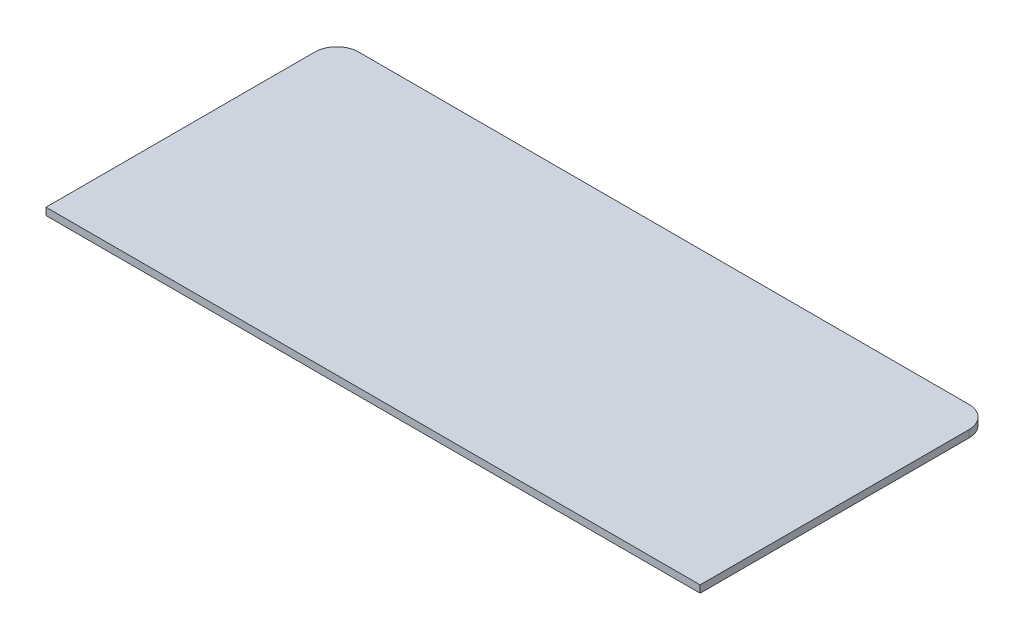
ISO-10303-21;
HEADER;
FILE_DESCRIPTION(('STEP AP214'),'2;1');
FILE_NAME('part.step','',(''),(''),'','','');
FILE_SCHEMA(('AUTOMOTIVE_DESIGN { 1 0 10303 214 1 1 1 1 }'));
ENDSEC;
DATA;
#1=APPLICATION_CONTEXT('core data for automotive mechanical design processes');
#2=APPLICATION_PROTOCOL_DEFINITION('international standard','automotive_design',2000,#1);
#3=PRODUCT_CONTEXT('',#1,'mechanical');
#4=PRODUCT('Part','Part','',(#3));
#5=PRODUCT_RELATED_PRODUCT_CATEGORY('part','',(#4));
#6=PRODUCT_DEFINITION_FORMATION('','',#4);
#7=PRODUCT_DEFINITION_CONTEXT('part definition',#1,'design');
#8=PRODUCT_DEFINITION('design','',#6,#7);
#9=PRODUCT_DEFINITION_SHAPE('','',#8);
#10=(LENGTH_UNIT() NAMED_UNIT(*) SI_UNIT(.MILLI.,.METRE.));
#11=(NAMED_UNIT(*) PLANE_ANGLE_UNIT() SI_UNIT($,.RADIAN.));
#12=(NAMED_UNIT(*) SI_UNIT($,.STERADIAN.) SOLID_ANGLE_UNIT());
#13=UNCERTAINTY_MEASURE_WITH_UNIT(LENGTH_MEASURE(1.E-05),#10,'distance_accuracy_value','');
#14=(GEOMETRIC_REPRESENTATION_CONTEXT(3) GLOBAL_UNCERTAINTY_ASSIGNED_CONTEXT((#13)) GLOBAL_UNIT_ASSIGNED_CONTEXT((#10,
#11,#12)) REPRESENTATION_CONTEXT('',''));
#15=CARTESIAN_POINT('',(0.,0.,0.));
#16=DIRECTION('',(0.,0.,1.));
#17=DIRECTION('',(1.,0.,0.));
#18=AXIS2_PLACEMENT_3D('',#15,#16,#17);
#19=CARTESIAN_POINT('',(0.,0.1,0.));
#20=DIRECTION('',(0.,0.,-1.));
#21=DIRECTION('',(-1.,0.,0.));
#22=AXIS2_PLACEMENT_3D('',#19,#20,#21);
#23=PLANE('',#22);
#24=DIRECTION('',(1.,0.,0.));
#25=VECTOR('',#24,1.);
#26=CARTESIAN_POINT('',(0.,0.,0.));
#27=LINE('',#26,#25);
#28=CARTESIAN_POINT('',(-4.5,0.,0.));
#29=VERTEX_POINT('',#28);
#30=CARTESIAN_POINT('',(4.5,0.,0.));
#31=VERTEX_POINT('',#30);
#32=EDGE_CURVE('E85',#29,#31,#27,.T.);
#33=ORIENTED_EDGE('',*,*,#32,.T.);
#34=DIRECTION('',(0.,-1.,0.));
#35=VECTOR('',#34,1.);
#36=CARTESIAN_POINT('',(4.5,0.1,0.));
#37=LINE('',#36,#35);
#38=CARTESIAN_POINT('',(4.5,0.1,0.));
#39=VERTEX_POINT('',#38);
#40=EDGE_CURVE('E11',#39,#31,#37,.T.);
#41=ORIENTED_EDGE('',*,*,#40,.F.);
#42=DIRECTION('',(1.,0.,0.));
#43=VECTOR('',#42,1.);
#44=CARTESIAN_POINT('',(-4.5,0.1,0.));
#45=LINE('',#44,#43);
#46=CARTESIAN_POINT('',(-4.5,0.1,0.));
#47=VERTEX_POINT('',#46);
#48=EDGE_CURVE('E91',#47,#39,#45,.T.);
#49=ORIENTED_EDGE('',*,*,#48,.F.);
#50=DIRECTION('',(0.,-1.,0.));
#51=VECTOR('',#50,1.);
#52=CARTESIAN_POINT('',(-4.5,0.1,0.));
#53=LINE('',#52,#51);
#54=EDGE_CURVE('E119',#47,#29,#53,.T.);
#55=ORIENTED_EDGE('',*,*,#54,.T.);
#56=EDGE_LOOP('',(#33,#41,#49,#55));
#57=FACE_BOUND('',#56,.T.);
#58=ADVANCED_FACE('F39',(#57),#23,.F.);
#59=CARTESIAN_POINT('',(4.5,0.1,0.));
#60=DIRECTION('',(-1.,0.,0.));
#61=DIRECTION('',(0.,0.,1.));
#62=AXIS2_PLACEMENT_3D('',#59,#60,#61);
#63=PLANE('',#62);
#64=DIRECTION('',(0.,0.,-1.));
#65=VECTOR('',#64,1.);
#66=CARTESIAN_POINT('',(4.5,0.,0.));
#67=LINE('',#66,#65);
#68=CARTESIAN_POINT('',(4.5,0.,-3.7));
#69=VERTEX_POINT('',#68);
#70=EDGE_CURVE('E124',#31,#69,#67,.T.);
#71=ORIENTED_EDGE('',*,*,#70,.T.);
#72=DIRECTION('',(0.,-1.,0.));
#73=VECTOR('',#72,1.);
#74=CARTESIAN_POINT('',(4.5,0.1,-3.7));
#75=LINE('',#74,#73);
#76=CARTESIAN_POINT('',(4.5,0.1,-3.7));
#77=VERTEX_POINT('',#76);
#78=EDGE_CURVE('E47',#77,#69,#75,.T.);
#79=ORIENTED_EDGE('',*,*,#78,.F.);
#80=DIRECTION('',(0.,0.,-1.));
#81=VECTOR('',#80,1.);
#82=CARTESIAN_POINT('',(4.5,0.1,0.));
#83=LINE('',#82,#81);
#84=EDGE_CURVE('E146',#39,#77,#83,.T.);
#85=ORIENTED_EDGE('',*,*,#84,.F.);
#86=ORIENTED_EDGE('',*,*,#40,.T.);
#87=EDGE_LOOP('',(#71,#79,#85,#86));
#88=FACE_BOUND('',#87,.T.);
#89=ADVANCED_FACE('F149',(#88),#63,.F.);
#90=CARTESIAN_POINT('',(4.2,0.1,-3.7));
#91=DIRECTION('',(0.,-1.,0.));
#92=DIRECTION('',(0.,0.,-1.));
#93=AXIS2_PLACEMENT_3D('',#90,#91,#92);
#94=CYLINDRICAL_SURFACE('',#93,0.3);
#95=CARTESIAN_POINT('',(4.2,0.,-3.7));
#96=DIRECTION('',(0.,1.,0.));
#97=DIRECTION('',(0.,0.,1.));
#98=AXIS2_PLACEMENT_3D('',#95,#96,#97);
#99=CIRCLE('',#98,0.3);
#100=CARTESIAN_POINT('',(4.2,0.,-4.));
#101=VERTEX_POINT('',#100);
#102=EDGE_CURVE('E126',#69,#101,#99,.T.);
#103=ORIENTED_EDGE('',*,*,#102,.T.);
#104=DIRECTION('',(0.,-1.,0.));
#105=VECTOR('',#104,1.);
#106=CARTESIAN_POINT('',(4.2,0.1,-4.));
#107=LINE('',#106,#105);
#108=CARTESIAN_POINT('',(4.2,0.1,-4.));
#109=VERTEX_POINT('',#108);
#110=EDGE_CURVE('E114',#109,#101,#107,.T.);
#111=ORIENTED_EDGE('',*,*,#110,.F.);
#112=CARTESIAN_POINT('',(4.2,0.1,-3.7));
#113=DIRECTION('',(0.,1.,0.));
#114=DIRECTION('',(0.,0.,1.));
#115=AXIS2_PLACEMENT_3D('',#112,#113,#114);
#116=CIRCLE('',#115,0.3);
#117=EDGE_CURVE('E105',#77,#109,#116,.T.);
#118=ORIENTED_EDGE('',*,*,#117,.F.);
#119=ORIENTED_EDGE('',*,*,#78,.T.);
#120=EDGE_LOOP('',(#103,#111,#118,#119));
#121=FACE_BOUND('',#120,.T.);
#122=ADVANCED_FACE('F139',(#121),#94,.T.);
#123=CARTESIAN_POINT('',(4.2,0.1,-4.));
#124=DIRECTION('',(0.,0.,1.));
#125=DIRECTION('',(1.,0.,0.));
#126=AXIS2_PLACEMENT_3D('',#123,#124,#125);
#127=PLANE('',#126);
#128=DIRECTION('',(-1.,0.,0.));
#129=VECTOR('',#128,1.);
#130=CARTESIAN_POINT('',(4.2,0.,-4.));
#131=LINE('',#130,#129);
#132=CARTESIAN_POINT('',(-4.2,0.,-4.));
#133=VERTEX_POINT('',#132);
#134=EDGE_CURVE('E113',#101,#133,#131,.T.);
#135=ORIENTED_EDGE('',*,*,#134,.T.);
#136=DIRECTION('',(0.,-1.,0.));
#137=VECTOR('',#136,1.);
#138=CARTESIAN_POINT('',(-4.2,0.1,-4.));
#139=LINE('',#138,#137);
#140=CARTESIAN_POINT('',(-4.2,0.1,-4.));
#141=VERTEX_POINT('',#140);
#142=EDGE_CURVE('E110',#141,#133,#139,.T.);
#143=ORIENTED_EDGE('',*,*,#142,.F.);
#144=DIRECTION('',(-1.,0.,0.));
#145=VECTOR('',#144,1.);
#146=CARTESIAN_POINT('',(4.2,0.1,-4.));
#147=LINE('',#146,#145);
#148=EDGE_CURVE('E99',#109,#141,#147,.T.);
#149=ORIENTED_EDGE('',*,*,#148,.F.);
#150=ORIENTED_EDGE('',*,*,#110,.T.);
#151=EDGE_LOOP('',(#135,#143,#149,#150));
#152=FACE_BOUND('',#151,.T.);
#153=ADVANCED_FACE('F111',(#152),#127,.F.);
#154=CARTESIAN_POINT('',(-4.2,0.1,-3.7));
#155=DIRECTION('',(0.,-1.,0.));
#156=DIRECTION('',(0.,0.,-1.));
#157=AXIS2_PLACEMENT_3D('',#154,#155,#156);
#158=CYLINDRICAL_SURFACE('',#157,0.3);
#159=CARTESIAN_POINT('',(-4.2,0.,-3.7));
#160=DIRECTION('',(0.,1.,0.));
#161=DIRECTION('',(0.,0.,1.));
#162=AXIS2_PLACEMENT_3D('',#159,#160,#161);
#163=CIRCLE('',#162,0.3);
#164=CARTESIAN_POINT('',(-4.5,0.,-3.7));
#165=VERTEX_POINT('',#164);
#166=EDGE_CURVE('E78',#133,#165,#163,.T.);
#167=ORIENTED_EDGE('',*,*,#166,.T.);
#168=DIRECTION('',(0.,-1.,0.));
#169=VECTOR('',#168,1.);
#170=CARTESIAN_POINT('',(-4.5,0.1,-3.7));
#171=LINE('',#170,#169);
#172=CARTESIAN_POINT('',(-4.5,0.1,-3.7));
#173=VERTEX_POINT('',#172);
#174=EDGE_CURVE('E115',#173,#165,#171,.T.);
#175=ORIENTED_EDGE('',*,*,#174,.F.);
#176=CARTESIAN_POINT('',(-4.2,0.1,-3.7));
#177=DIRECTION('',(0.,1.,0.));
#178=DIRECTION('',(0.,0.,1.));
#179=AXIS2_PLACEMENT_3D('',#176,#177,#178);
#180=CIRCLE('',#179,0.3);
#181=EDGE_CURVE('E103',#141,#173,#180,.T.);
#182=ORIENTED_EDGE('',*,*,#181,.F.);
#183=ORIENTED_EDGE('',*,*,#142,.T.);
#184=EDGE_LOOP('',(#167,#175,#182,#183));
#185=FACE_BOUND('',#184,.T.);
#186=ADVANCED_FACE('F117',(#185),#158,.T.);
#187=CARTESIAN_POINT('',(-4.5,0.1,-3.7));
#188=DIRECTION('',(1.,0.,0.));
#189=DIRECTION('',(0.,0.,-1.));
#190=AXIS2_PLACEMENT_3D('',#187,#188,#189);
#191=PLANE('',#190);
#192=DIRECTION('',(0.,0.,1.));
#193=VECTOR('',#192,1.);
#194=CARTESIAN_POINT('',(-4.5,0.,-3.7));
#195=LINE('',#194,#193);
#196=EDGE_CURVE('E130',#165,#29,#195,.T.);
#197=ORIENTED_EDGE('',*,*,#196,.T.);
#198=ORIENTED_EDGE('',*,*,#54,.F.);
#199=DIRECTION('',(0.,0.,1.));
#200=VECTOR('',#199,1.);
#201=CARTESIAN_POINT('',(-4.5,0.1,-3.7));
#202=LINE('',#201,#200);
#203=EDGE_CURVE('E55',#173,#47,#202,.T.);
#204=ORIENTED_EDGE('',*,*,#203,.F.);
#205=ORIENTED_EDGE('',*,*,#174,.T.);
#206=EDGE_LOOP('',(#197,#198,#204,#205));
#207=FACE_BOUND('',#206,.T.);
#208=ADVANCED_FACE('F144',(#207),#191,.F.);
#209=CARTESIAN_POINT('',(4.2,0.1,-3.7));
#210=DIRECTION('',(0.,1.,0.));
#211=DIRECTION('',(0.,0.,1.));
#212=AXIS2_PLACEMENT_3D('',#209,#210,#211);
#213=PLANE('',#212);
#214=ORIENTED_EDGE('',*,*,#48,.T.);
#215=ORIENTED_EDGE('',*,*,#84,.T.);
#216=ORIENTED_EDGE('',*,*,#117,.T.);
#217=ORIENTED_EDGE('',*,*,#148,.T.);
#218=ORIENTED_EDGE('',*,*,#181,.T.);
#219=ORIENTED_EDGE('',*,*,#203,.T.);
#220=EDGE_LOOP('',(#214,#215,#216,#217,#218,#219));
#221=FACE_BOUND('',#220,.T.);
#222=ADVANCED_FACE('F101',(#221),#213,.T.);
#223=CARTESIAN_POINT('',(4.2,0.,-3.7));
#224=DIRECTION('',(0.,1.,0.));
#225=DIRECTION('',(0.,0.,1.));
#226=AXIS2_PLACEMENT_3D('',#223,#224,#225);
#227=PLANE('',#226);
#228=ORIENTED_EDGE('',*,*,#32,.F.);
#229=ORIENTED_EDGE('',*,*,#196,.F.);
#230=ORIENTED_EDGE('',*,*,#166,.F.);
#231=ORIENTED_EDGE('',*,*,#134,.F.);
#232=ORIENTED_EDGE('',*,*,#102,.F.);
#233=ORIENTED_EDGE('',*,*,#70,.F.);
#234=EDGE_LOOP('',(#228,#229,#230,#231,#232,#233));
#235=FACE_BOUND('',#234,.T.);
#236=ADVANCED_FACE('F142',(#235),#227,.F.);
#237=CLOSED_SHELL('',(#58,#89,#122,#153,#186,#208,#222,#236));
#238=MANIFOLD_SOLID_BREP('B2',#237);
#239=ADVANCED_BREP_SHAPE_REPRESENTATION('',(#18,#238),#14);
#240=SHAPE_DEFINITION_REPRESENTATION(#9,#239);
ENDSEC;
END-ISO-10303-21;
